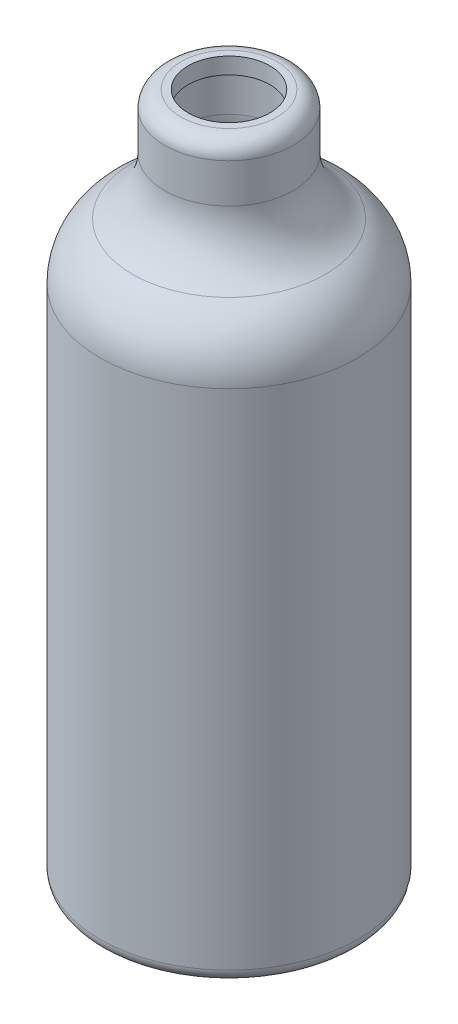
ISO-10303-21;
HEADER;
FILE_DESCRIPTION(('STEP AP214'),'2;1');
FILE_NAME('part.step','',(''),(''),'','','');
FILE_SCHEMA(('AUTOMOTIVE_DESIGN { 1 0 10303 214 1 1 1 1 }'));
ENDSEC;
DATA;
#1=APPLICATION_CONTEXT('core data for automotive mechanical design processes');
#2=APPLICATION_PROTOCOL_DEFINITION('international standard','automotive_design',2000,#1);
#3=PRODUCT_CONTEXT('',#1,'mechanical');
#4=PRODUCT('Part','Part','',(#3));
#5=PRODUCT_RELATED_PRODUCT_CATEGORY('part','',(#4));
#6=PRODUCT_DEFINITION_FORMATION('','',#4);
#7=PRODUCT_DEFINITION_CONTEXT('part definition',#1,'design');
#8=PRODUCT_DEFINITION('design','',#6,#7);
#9=PRODUCT_DEFINITION_SHAPE('','',#8);
#10=(LENGTH_UNIT() NAMED_UNIT(*) SI_UNIT(.MILLI.,.METRE.));
#11=(NAMED_UNIT(*) PLANE_ANGLE_UNIT() SI_UNIT($,.RADIAN.));
#12=(NAMED_UNIT(*) SI_UNIT($,.STERADIAN.) SOLID_ANGLE_UNIT());
#13=UNCERTAINTY_MEASURE_WITH_UNIT(LENGTH_MEASURE(1.E-05),#10,'distance_accuracy_value','');
#14=(GEOMETRIC_REPRESENTATION_CONTEXT(3) GLOBAL_UNCERTAINTY_ASSIGNED_CONTEXT((#13)) GLOBAL_UNIT_ASSIGNED_CONTEXT((#10,
#11,#12)) REPRESENTATION_CONTEXT('',''));
#15=CARTESIAN_POINT('',(0.,0.,0.));
#16=DIRECTION('',(0.,0.,1.));
#17=DIRECTION('',(1.,0.,0.));
#18=AXIS2_PLACEMENT_3D('',#15,#16,#17);
#19=CARTESIAN_POINT('',(0.,3.175,0.));
#20=DIRECTION('',(0.,-1.,0.));
#21=DIRECTION('',(1.,0.,0.));
#22=AXIS2_PLACEMENT_3D('',#19,#20,#21);
#23=PLANE('',#22);
#24=CARTESIAN_POINT('',(0.,3.17500000000001,0.));
#25=DIRECTION('',(0.,1.,0.));
#26=DIRECTION('',(-1.,0.,0.));
#27=AXIS2_PLACEMENT_3D('',#24,#25,#26);
#28=CIRCLE('',#27,21.825);
#29=CARTESIAN_POINT('',(-21.825,3.17500000000001,0.));
#30=VERTEX_POINT('',#29);
#31=EDGE_CURVE('E10',#30,#30,#28,.T.);
#32=ORIENTED_EDGE('',*,*,#31,.T.);
#33=EDGE_LOOP('',(#32));
#34=FACE_BOUND('',#33,.T.);
#35=ADVANCED_FACE('F37',(#34),#23,.F.);
#36=CARTESIAN_POINT('',(0.,133.,0.));
#37=DIRECTION('',(0.,1.,0.));
#38=DIRECTION('',(-1.,0.,0.));
#39=AXIS2_PLACEMENT_3D('',#36,#37,#38);
#40=CYLINDRICAL_SURFACE('',#39,21.825);
#41=ORIENTED_EDGE('',*,*,#31,.F.);
#42=EDGE_LOOP('',(#41));
#43=FACE_BOUND('',#42,.T.);
#44=CARTESIAN_POINT('',(0.,100.324643512959,0.));
#45=DIRECTION('',(0.,1.,0.));
#46=DIRECTION('',(-1.,0.,0.));
#47=AXIS2_PLACEMENT_3D('',#44,#45,#46);
#48=CIRCLE('',#47,21.825);
#49=CARTESIAN_POINT('',(-21.825,100.324643512959,0.));
#50=VERTEX_POINT('',#49);
#51=EDGE_CURVE('E45',#50,#50,#48,.T.);
#52=ORIENTED_EDGE('',*,*,#51,.T.);
#53=EDGE_LOOP('',(#52));
#54=FACE_BOUND('',#53,.T.);
#55=ADVANCED_FACE('F119',(#43,#54),#40,.F.);
#56=CARTESIAN_POINT('',(0.,100.324643512959,0.));
#57=DIRECTION('',(0.,1.,0.));
#58=DIRECTION('',(-1.,0.,0.));
#59=AXIS2_PLACEMENT_3D('',#56,#57,#58);
#60=TOROIDAL_SURFACE('',#59,12.3,9.525);
#61=ORIENTED_EDGE('',*,*,#51,.F.);
#62=EDGE_LOOP('',(#61));
#63=FACE_BOUND('',#62,.T.);
#64=CARTESIAN_POINT('',(0.,108.529777195599,0.));
#65=DIRECTION('',(0.,1.,0.));
#66=DIRECTION('',(-1.,0.,0.));
#67=AXIS2_PLACEMENT_3D('',#64,#65,#66);
#68=CIRCLE('',#67,17.1375);
#69=CARTESIAN_POINT('',(-17.1375,108.529777195599,0.));
#70=VERTEX_POINT('',#69);
#71=EDGE_CURVE('E50',#70,#70,#68,.T.);
#72=ORIENTED_EDGE('',*,*,#71,.T.);
#73=EDGE_LOOP('',(#72));
#74=FACE_BOUND('',#73,.T.);
#75=ADVANCED_FACE('F123',(#63,#74),#60,.F.);
#76=CARTESIAN_POINT('',(0.,122.205,0.));
#77=DIRECTION('',(0.,1.,0.));
#78=DIRECTION('',(-1.,0.,0.));
#79=AXIS2_PLACEMENT_3D('',#76,#77,#78);
#80=TOROIDAL_SURFACE('',#79,25.2,15.875);
#81=ORIENTED_EDGE('',*,*,#71,.F.);
#82=EDGE_LOOP('',(#81));
#83=FACE_BOUND('',#82,.T.);
#84=CARTESIAN_POINT('',(0.,122.205,0.));
#85=DIRECTION('',(0.,1.,0.));
#86=DIRECTION('',(-1.,0.,0.));
#87=AXIS2_PLACEMENT_3D('',#84,#85,#86);
#88=CIRCLE('',#87,9.32500000000001);
#89=CARTESIAN_POINT('',(-9.32500000000001,122.205,0.));
#90=VERTEX_POINT('',#89);
#91=EDGE_CURVE('E56',#90,#90,#88,.T.);
#92=ORIENTED_EDGE('',*,*,#91,.T.);
#93=EDGE_LOOP('',(#92));
#94=FACE_BOUND('',#93,.T.);
#95=ADVANCED_FACE('F128',(#83,#94),#80,.T.);
#96=CARTESIAN_POINT('',(0.,133.,0.));
#97=DIRECTION('',(0.,1.,0.));
#98=DIRECTION('',(-1.,0.,0.));
#99=AXIS2_PLACEMENT_3D('',#96,#97,#98);
#100=CYLINDRICAL_SURFACE('',#99,9.32500000000001);
#101=ORIENTED_EDGE('',*,*,#91,.F.);
#102=EDGE_LOOP('',(#101));
#103=FACE_BOUND('',#102,.T.);
#104=CARTESIAN_POINT('',(0.,129.825,0.));
#105=DIRECTION('',(0.,1.,0.));
#106=DIRECTION('',(-1.,0.,0.));
#107=AXIS2_PLACEMENT_3D('',#104,#105,#106);
#108=CIRCLE('',#107,9.32500000000001);
#109=CARTESIAN_POINT('',(-9.32500000000001,129.825,0.));
#110=VERTEX_POINT('',#109);
#111=EDGE_CURVE('E60',#110,#110,#108,.T.);
#112=ORIENTED_EDGE('',*,*,#111,.T.);
#113=EDGE_LOOP('',(#112));
#114=FACE_BOUND('',#113,.T.);
#115=ADVANCED_FACE('F115',(#103,#114),#100,.F.);
#116=CARTESIAN_POINT('',(0.,129.825,0.));
#117=DIRECTION('',(0.,1.,0.));
#118=DIRECTION('',(-1.,0.,0.));
#119=AXIS2_PLACEMENT_3D('',#116,#117,#118);
#120=PLANE('',#119);
#121=CARTESIAN_POINT('',(0.,129.825,0.));
#122=DIRECTION('',(0.,1.,0.));
#123=DIRECTION('',(-1.,0.,0.));
#124=AXIS2_PLACEMENT_3D('',#121,#122,#123);
#125=CIRCLE('',#124,7.9375);
#126=CARTESIAN_POINT('',(-7.93750000000001,129.825,0.));
#127=VERTEX_POINT('',#126);
#128=EDGE_CURVE('E40',#127,#127,#125,.T.);
#129=ORIENTED_EDGE('',*,*,#128,.T.);
#130=EDGE_LOOP('',(#129));
#131=FACE_BOUND('',#130,.T.);
#132=ORIENTED_EDGE('',*,*,#111,.F.);
#133=EDGE_LOOP('',(#132));
#134=FACE_BOUND('',#133,.T.);
#135=ADVANCED_FACE('F101',(#131,#134),#120,.F.);
#136=CARTESIAN_POINT('',(0.,120.3,0.));
#137=DIRECTION('',(0.,1.,0.));
#138=DIRECTION('',(-1.,0.,0.));
#139=AXIS2_PLACEMENT_3D('',#136,#137,#138);
#140=CYLINDRICAL_SURFACE('',#139,7.9375);
#141=CARTESIAN_POINT('',(0.,133.,0.));
#142=DIRECTION('',(0.,1.,0.));
#143=DIRECTION('',(-1.,0.,0.));
#144=AXIS2_PLACEMENT_3D('',#141,#142,#143);
#145=CIRCLE('',#144,7.9375);
#146=CARTESIAN_POINT('',(-7.93750000000001,133.,0.));
#147=VERTEX_POINT('',#146);
#148=EDGE_CURVE('E92',#147,#147,#145,.T.);
#149=ORIENTED_EDGE('',*,*,#148,.T.);
#150=EDGE_LOOP('',(#149));
#151=FACE_BOUND('',#150,.T.);
#152=ORIENTED_EDGE('',*,*,#128,.F.);
#153=EDGE_LOOP('',(#152));
#154=FACE_BOUND('',#153,.T.);
#155=ADVANCED_FACE('F104',(#151,#154),#140,.F.);
#156=CARTESIAN_POINT('',(0.,133.,0.));
#157=DIRECTION('',(0.,1.,0.));
#158=DIRECTION('',(-1.,0.,0.));
#159=AXIS2_PLACEMENT_3D('',#156,#157,#158);
#160=PLANE('',#159);
#161=ORIENTED_EDGE('',*,*,#148,.F.);
#162=EDGE_LOOP('',(#161));
#163=FACE_BOUND('',#162,.T.);
#164=CARTESIAN_POINT('',(0.,133.,0.));
#165=DIRECTION('',(0.,1.,0.));
#166=DIRECTION('',(-1.,0.,0.));
#167=AXIS2_PLACEMENT_3D('',#164,#165,#166);
#168=CIRCLE('',#167,9.32499999999999);
#169=CARTESIAN_POINT('',(-9.32499999999999,133.,0.));
#170=VERTEX_POINT('',#169);
#171=EDGE_CURVE('E64',#170,#170,#168,.T.);
#172=ORIENTED_EDGE('',*,*,#171,.T.);
#173=EDGE_LOOP('',(#172));
#174=FACE_BOUND('',#173,.T.);
#175=ADVANCED_FACE('F106',(#163,#174),#160,.T.);
#176=CARTESIAN_POINT('',(0.,129.825,0.));
#177=DIRECTION('',(0.,1.,0.));
#178=DIRECTION('',(-1.,0.,0.));
#179=AXIS2_PLACEMENT_3D('',#176,#177,#178);
#180=TOROIDAL_SURFACE('',#179,9.325,3.17500000000001);
#181=CARTESIAN_POINT('',(0.,129.825,0.));
#182=DIRECTION('',(0.,1.,0.));
#183=DIRECTION('',(-1.,0.,0.));
#184=AXIS2_PLACEMENT_3D('',#181,#182,#183);
#185=CIRCLE('',#184,12.5);
#186=CARTESIAN_POINT('',(-12.5,129.825,0.));
#187=VERTEX_POINT('',#186);
#188=EDGE_CURVE('E68',#187,#187,#185,.T.);
#189=ORIENTED_EDGE('',*,*,#188,.T.);
#190=EDGE_LOOP('',(#189));
#191=FACE_BOUND('',#190,.T.);
#192=ORIENTED_EDGE('',*,*,#171,.F.);
#193=EDGE_LOOP('',(#192));
#194=FACE_BOUND('',#193,.T.);
#195=ADVANCED_FACE('F112',(#191,#194),#180,.T.);
#196=CARTESIAN_POINT('',(0.,133.,0.));
#197=DIRECTION('',(0.,1.,0.));
#198=DIRECTION('',(-1.,0.,0.));
#199=AXIS2_PLACEMENT_3D('',#196,#197,#198);
#200=CYLINDRICAL_SURFACE('',#199,12.5);
#201=CARTESIAN_POINT('',(0.,122.205,0.));
#202=DIRECTION('',(0.,1.,0.));
#203=DIRECTION('',(-1.,0.,0.));
#204=AXIS2_PLACEMENT_3D('',#201,#202,#203);
#205=CIRCLE('',#204,12.5);
#206=CARTESIAN_POINT('',(-12.5,122.205,0.));
#207=VERTEX_POINT('',#206);
#208=EDGE_CURVE('E72',#207,#207,#205,.T.);
#209=ORIENTED_EDGE('',*,*,#208,.T.);
#210=EDGE_LOOP('',(#209));
#211=FACE_BOUND('',#210,.T.);
#212=ORIENTED_EDGE('',*,*,#188,.F.);
#213=EDGE_LOOP('',(#212));
#214=FACE_BOUND('',#213,.T.);
#215=ADVANCED_FACE('F141',(#211,#214),#200,.T.);
#216=CARTESIAN_POINT('',(0.,122.205,0.));
#217=DIRECTION('',(0.,1.,0.));
#218=DIRECTION('',(-1.,0.,0.));
#219=AXIS2_PLACEMENT_3D('',#216,#217,#218);
#220=TOROIDAL_SURFACE('',#219,25.2,12.7);
#221=CARTESIAN_POINT('',(0.,111.264821756479,0.));
#222=DIRECTION('',(0.,1.,0.));
#223=DIRECTION('',(-1.,0.,0.));
#224=AXIS2_PLACEMENT_3D('',#221,#222,#223);
#225=CIRCLE('',#224,18.75);
#226=CARTESIAN_POINT('',(-18.75,111.264821756479,0.));
#227=VERTEX_POINT('',#226);
#228=EDGE_CURVE('E76',#227,#227,#225,.T.);
#229=ORIENTED_EDGE('',*,*,#228,.T.);
#230=EDGE_LOOP('',(#229));
#231=FACE_BOUND('',#230,.T.);
#232=ORIENTED_EDGE('',*,*,#208,.F.);
#233=EDGE_LOOP('',(#232));
#234=FACE_BOUND('',#233,.T.);
#235=ADVANCED_FACE('F145',(#231,#234),#220,.F.);
#236=CARTESIAN_POINT('',(0.,100.324643512959,0.));
#237=DIRECTION('',(0.,1.,0.));
#238=DIRECTION('',(-1.,0.,0.));
#239=AXIS2_PLACEMENT_3D('',#236,#237,#238);
#240=DEGENERATE_TOROIDAL_SURFACE('',#239,12.3,12.7,.T.);
#241=CARTESIAN_POINT('',(0.,100.324643512959,0.));
#242=DIRECTION('',(0.,1.,0.));
#243=DIRECTION('',(-1.,0.,0.));
#244=AXIS2_PLACEMENT_3D('',#241,#242,#243);
#245=CIRCLE('',#244,25.);
#246=CARTESIAN_POINT('',(-25.,100.324643512959,0.));
#247=VERTEX_POINT('',#246);
#248=EDGE_CURVE('E80',#247,#247,#245,.T.);
#249=ORIENTED_EDGE('',*,*,#248,.T.);
#250=EDGE_LOOP('',(#249));
#251=FACE_BOUND('',#250,.T.);
#252=ORIENTED_EDGE('',*,*,#228,.F.);
#253=EDGE_LOOP('',(#252));
#254=FACE_BOUND('',#253,.T.);
#255=ADVANCED_FACE('F149',(#251,#254),#240,.T.);
#256=CARTESIAN_POINT('',(0.,133.,0.));
#257=DIRECTION('',(0.,1.,0.));
#258=DIRECTION('',(-1.,0.,0.));
#259=AXIS2_PLACEMENT_3D('',#256,#257,#258);
#260=CYLINDRICAL_SURFACE('',#259,25.);
#261=CARTESIAN_POINT('',(0.,2.54000000000001,0.));
#262=DIRECTION('',(0.,1.,0.));
#263=DIRECTION('',(-1.,0.,0.));
#264=AXIS2_PLACEMENT_3D('',#261,#262,#263);
#265=CIRCLE('',#264,25.);
#266=CARTESIAN_POINT('',(-25.,2.54000000000001,0.));
#267=VERTEX_POINT('',#266);
#268=EDGE_CURVE('E84',#267,#267,#265,.T.);
#269=ORIENTED_EDGE('',*,*,#268,.T.);
#270=EDGE_LOOP('',(#269));
#271=FACE_BOUND('',#270,.T.);
#272=ORIENTED_EDGE('',*,*,#248,.F.);
#273=EDGE_LOOP('',(#272));
#274=FACE_BOUND('',#273,.T.);
#275=ADVANCED_FACE('F153',(#271,#274),#260,.T.);
#276=CARTESIAN_POINT('',(0.,2.54,0.));
#277=DIRECTION('',(0.,1.,0.));
#278=DIRECTION('',(-1.,0.,0.));
#279=AXIS2_PLACEMENT_3D('',#276,#277,#278);
#280=TOROIDAL_SURFACE('',#279,22.46,2.54);
#281=CARTESIAN_POINT('',(0.,0.,0.));
#282=DIRECTION('',(0.,1.,0.));
#283=DIRECTION('',(-1.,0.,0.));
#284=AXIS2_PLACEMENT_3D('',#281,#282,#283);
#285=CIRCLE('',#284,22.46);
#286=CARTESIAN_POINT('',(-22.46,0.,0.));
#287=VERTEX_POINT('',#286);
#288=EDGE_CURVE('E88',#287,#287,#285,.T.);
#289=ORIENTED_EDGE('',*,*,#288,.T.);
#290=EDGE_LOOP('',(#289));
#291=FACE_BOUND('',#290,.T.);
#292=ORIENTED_EDGE('',*,*,#268,.F.);
#293=EDGE_LOOP('',(#292));
#294=FACE_BOUND('',#293,.T.);
#295=ADVANCED_FACE('F157',(#291,#294),#280,.T.);
#296=CARTESIAN_POINT('',(0.,0.,0.));
#297=DIRECTION('',(0.,-1.,0.));
#298=DIRECTION('',(1.,0.,0.));
#299=AXIS2_PLACEMENT_3D('',#296,#297,#298);
#300=PLANE('',#299);
#301=ORIENTED_EDGE('',*,*,#288,.F.);
#302=EDGE_LOOP('',(#301));
#303=FACE_BOUND('',#302,.T.);
#304=ADVANCED_FACE('F160',(#303),#300,.T.);
#305=CLOSED_SHELL('',(#35,#55,#75,#95,#115,#135,#155,#175,#195,#215,#235,#255,#275,#295,#304));
#306=MANIFOLD_SOLID_BREP('B2',#305);
#307=ADVANCED_BREP_SHAPE_REPRESENTATION('',(#18,#306),#14);
#308=SHAPE_DEFINITION_REPRESENTATION(#9,#307);
ENDSEC;
END-ISO-10303-21;
